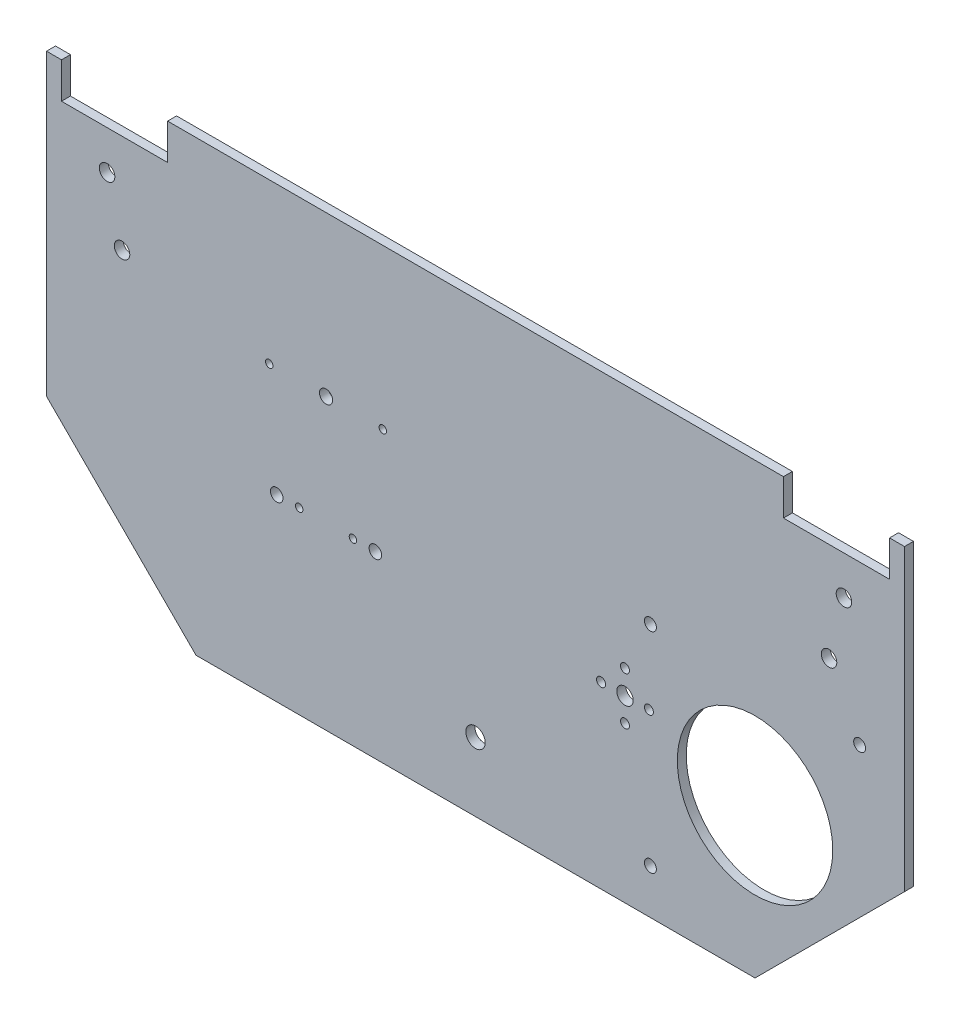
ISO-10303-21;
HEADER;
FILE_DESCRIPTION(('STEP AP214'),'2;1');
FILE_NAME('part.step','',(''),(''),'','','');
FILE_SCHEMA(('AUTOMOTIVE_DESIGN { 1 0 10303 214 1 1 1 1 }'));
ENDSEC;
DATA;
#1=APPLICATION_CONTEXT('core data for automotive mechanical design processes');
#2=APPLICATION_PROTOCOL_DEFINITION('international standard','automotive_design',2000,#1);
#3=PRODUCT_CONTEXT('',#1,'mechanical');
#4=PRODUCT('Part','Part','',(#3));
#5=PRODUCT_RELATED_PRODUCT_CATEGORY('part','',(#4));
#6=PRODUCT_DEFINITION_FORMATION('','',#4);
#7=PRODUCT_DEFINITION_CONTEXT('part definition',#1,'design');
#8=PRODUCT_DEFINITION('design','',#6,#7);
#9=PRODUCT_DEFINITION_SHAPE('','',#8);
#10=(LENGTH_UNIT() NAMED_UNIT(*) SI_UNIT(.MILLI.,.METRE.));
#11=(NAMED_UNIT(*) PLANE_ANGLE_UNIT() SI_UNIT($,.RADIAN.));
#12=(NAMED_UNIT(*) SI_UNIT($,.STERADIAN.) SOLID_ANGLE_UNIT());
#13=UNCERTAINTY_MEASURE_WITH_UNIT(LENGTH_MEASURE(1.E-05),#10,'distance_accuracy_value','');
#14=(GEOMETRIC_REPRESENTATION_CONTEXT(3) GLOBAL_UNCERTAINTY_ASSIGNED_CONTEXT((#13)) GLOBAL_UNIT_ASSIGNED_CONTEXT((#10,
#11,#12)) REPRESENTATION_CONTEXT('',''));
#15=CARTESIAN_POINT('',(0.,0.,0.));
#16=DIRECTION('',(0.,0.,1.));
#17=DIRECTION('',(1.,0.,0.));
#18=AXIS2_PLACEMENT_3D('',#15,#16,#17);
#19=CARTESIAN_POINT('',(0.,0.,3.));
#20=DIRECTION('',(0.,0.,1.));
#21=DIRECTION('',(1.,0.,0.));
#22=AXIS2_PLACEMENT_3D('',#19,#20,#21);
#23=PLANE('',#22);
#24=CARTESIAN_POINT('',(272.,85.,3.));
#25=DIRECTION('',(0.,0.,-1.));
#26=DIRECTION('',(-1.,0.,0.));
#27=AXIS2_PLACEMENT_3D('',#24,#25,#26);
#28=CIRCLE('',#27,2.);
#29=CARTESIAN_POINT('',(270.,85.,3.));
#30=VERTEX_POINT('',#29);
#31=EDGE_CURVE('E383',#30,#30,#28,.T.);
#32=ORIENTED_EDGE('',*,*,#31,.T.);
#33=EDGE_LOOP('',(#32));
#34=FACE_BOUND('',#33,.T.);
#35=CARTESIAN_POINT('',(202.,15.,3.));
#36=DIRECTION('',(0.,0.,-1.));
#37=DIRECTION('',(-1.,0.,0.));
#38=AXIS2_PLACEMENT_3D('',#35,#36,#37);
#39=CIRCLE('',#38,2.);
#40=CARTESIAN_POINT('',(200.,15.,3.));
#41=VERTEX_POINT('',#40);
#42=EDGE_CURVE('E378',#41,#41,#39,.T.);
#43=ORIENTED_EDGE('',*,*,#42,.T.);
#44=EDGE_LOOP('',(#43));
#45=FACE_BOUND('',#44,.T.);
#46=CARTESIAN_POINT('',(202.,85.,3.));
#47=DIRECTION('',(0.,0.,-1.));
#48=DIRECTION('',(-1.,0.,0.));
#49=AXIS2_PLACEMENT_3D('',#46,#47,#48);
#50=CIRCLE('',#49,2.);
#51=CARTESIAN_POINT('',(200.,85.,3.));
#52=VERTEX_POINT('',#51);
#53=EDGE_CURVE('E392',#52,#52,#50,.T.);
#54=ORIENTED_EDGE('',*,*,#53,.T.);
#55=EDGE_LOOP('',(#54));
#56=FACE_BOUND('',#55,.T.);
#57=CARTESIAN_POINT('',(193.5,52.0000000000001,3.));
#58=DIRECTION('',(0.,0.,1.));
#59=DIRECTION('',(1.,0.,0.));
#60=AXIS2_PLACEMENT_3D('',#57,#58,#59);
#61=CIRCLE('',#60,1.5);
#62=CARTESIAN_POINT('',(195.,52.0000000000001,3.));
#63=VERTEX_POINT('',#62);
#64=EDGE_CURVE('E404',#63,#63,#61,.T.);
#65=ORIENTED_EDGE('',*,*,#64,.F.);
#66=EDGE_LOOP('',(#65));
#67=FACE_BOUND('',#66,.T.);
#68=CARTESIAN_POINT('',(143.5,23.,3.));
#69=DIRECTION('',(0.,0.,1.));
#70=DIRECTION('',(1.,0.,0.));
#71=AXIS2_PLACEMENT_3D('',#68,#69,#70);
#72=CIRCLE('',#71,3.24999999999998);
#73=CARTESIAN_POINT('',(146.75,23.,3.));
#74=VERTEX_POINT('',#73);
#75=EDGE_CURVE('E416',#74,#74,#72,.T.);
#76=ORIENTED_EDGE('',*,*,#75,.F.);
#77=EDGE_LOOP('',(#76));
#78=FACE_BOUND('',#77,.T.);
#79=CARTESIAN_POINT('',(201.5,60.,3.));
#80=DIRECTION('',(0.,0.,1.));
#81=DIRECTION('',(1.,0.,0.));
#82=AXIS2_PLACEMENT_3D('',#79,#80,#81);
#83=CIRCLE('',#82,1.5);
#84=CARTESIAN_POINT('',(203.,60.,3.));
#85=VERTEX_POINT('',#84);
#86=EDGE_CURVE('E428',#85,#85,#83,.T.);
#87=ORIENTED_EDGE('',*,*,#86,.F.);
#88=EDGE_LOOP('',(#87));
#89=FACE_BOUND('',#88,.T.);
#90=CARTESIAN_POINT('',(112.5,96.7,3.));
#91=DIRECTION('',(0.,0.,1.));
#92=DIRECTION('',(1.,0.,0.));
#93=AXIS2_PLACEMENT_3D('',#90,#91,#92);
#94=CIRCLE('',#93,1.25);
#95=CARTESIAN_POINT('',(113.75,96.7,3.));
#96=VERTEX_POINT('',#95);
#97=EDGE_CURVE('E440',#96,#96,#94,.T.);
#98=ORIENTED_EDGE('',*,*,#97,.F.);
#99=EDGE_LOOP('',(#98));
#100=FACE_BOUND('',#99,.T.);
#101=CARTESIAN_POINT('',(84.5,60.,3.));
#102=DIRECTION('',(0.,0.,1.));
#103=DIRECTION('',(1.,0.,0.));
#104=AXIS2_PLACEMENT_3D('',#101,#102,#103);
#105=CIRCLE('',#104,1.25000000000001);
#106=CARTESIAN_POINT('',(85.7500000000001,60.,3.));
#107=VERTEX_POINT('',#106);
#108=EDGE_CURVE('E452',#107,#107,#105,.T.);
#109=ORIENTED_EDGE('',*,*,#108,.F.);
#110=EDGE_LOOP('',(#109));
#111=FACE_BOUND('',#110,.T.);
#112=CARTESIAN_POINT('',(110.,60.,3.));
#113=DIRECTION('',(0.,0.,1.));
#114=DIRECTION('',(1.,0.,0.));
#115=AXIS2_PLACEMENT_3D('',#112,#113,#114);
#116=CIRCLE('',#115,2.10000000000005);
#117=CARTESIAN_POINT('',(112.1,60.,3.));
#118=VERTEX_POINT('',#117);
#119=EDGE_CURVE('E464',#118,#118,#116,.T.);
#120=ORIENTED_EDGE('',*,*,#119,.F.);
#121=EDGE_LOOP('',(#120));
#122=FACE_BOUND('',#121,.T.);
#123=CARTESIAN_POINT('',(74.5,96.7,3.));
#124=DIRECTION('',(0.,0.,1.));
#125=DIRECTION('',(1.,0.,0.));
#126=AXIS2_PLACEMENT_3D('',#123,#124,#125);
#127=CIRCLE('',#126,1.25000000000001);
#128=CARTESIAN_POINT('',(75.75,96.7,3.));
#129=VERTEX_POINT('',#128);
#130=EDGE_CURVE('E476',#129,#129,#127,.T.);
#131=ORIENTED_EDGE('',*,*,#130,.F.);
#132=EDGE_LOOP('',(#131));
#133=FACE_BOUND('',#132,.T.);
#134=CARTESIAN_POINT('',(25.25,105.,3.));
#135=DIRECTION('',(0.,0.,1.));
#136=DIRECTION('',(1.,0.,0.));
#137=AXIS2_PLACEMENT_3D('',#134,#135,#136);
#138=CIRCLE('',#137,2.59999999999999);
#139=CARTESIAN_POINT('',(27.85,105.,3.));
#140=VERTEX_POINT('',#139);
#141=EDGE_CURVE('E488',#140,#140,#138,.T.);
#142=ORIENTED_EDGE('',*,*,#141,.F.);
#143=EDGE_LOOP('',(#142));
#144=FACE_BOUND('',#143,.T.);
#145=CARTESIAN_POINT('',(266.75,125.,3.));
#146=DIRECTION('',(0.,0.,1.));
#147=DIRECTION('',(1.,0.,0.));
#148=AXIS2_PLACEMENT_3D('',#145,#146,#147);
#149=CIRCLE('',#148,2.60000000000007);
#150=CARTESIAN_POINT('',(269.35,125.,3.));
#151=VERTEX_POINT('',#150);
#152=EDGE_CURVE('E170',#151,#151,#149,.T.);
#153=ORIENTED_EDGE('',*,*,#152,.F.);
#154=EDGE_LOOP('',(#153));
#155=FACE_BOUND('',#154,.T.);
#156=DIRECTION('',(0.,1.,0.));
#157=VECTOR('',#156,1.);
#158=CARTESIAN_POINT('',(5.,138.,3.));
#159=LINE('',#158,#157);
#160=CARTESIAN_POINT('',(5.,138.,3.));
#161=VERTEX_POINT('',#160);
#162=CARTESIAN_POINT('',(5.,150.,3.));
#163=VERTEX_POINT('',#162);
#164=EDGE_CURVE('E193',#161,#163,#159,.T.);
#165=ORIENTED_EDGE('',*,*,#164,.T.);
#166=DIRECTION('',(-1.,0.,0.));
#167=VECTOR('',#166,1.);
#168=CARTESIAN_POINT('',(5.,150.,3.));
#169=LINE('',#168,#167);
#170=CARTESIAN_POINT('',(0.,150.,3.));
#171=VERTEX_POINT('',#170);
#172=EDGE_CURVE('E111',#163,#171,#169,.T.);
#173=ORIENTED_EDGE('',*,*,#172,.T.);
#174=DIRECTION('',(0.,-1.,0.));
#175=VECTOR('',#174,1.);
#176=CARTESIAN_POINT('',(0.,150.,3.));
#177=LINE('',#176,#175);
#178=CARTESIAN_POINT('',(0.,50.,3.));
#179=VERTEX_POINT('',#178);
#180=EDGE_CURVE('E226',#171,#179,#177,.T.);
#181=ORIENTED_EDGE('',*,*,#180,.T.);
#182=DIRECTION('',(0.707106781186548,-0.707106781186548,0.));
#183=VECTOR('',#182,1.);
#184=CARTESIAN_POINT('',(0.,50.,3.));
#185=LINE('',#184,#183);
#186=CARTESIAN_POINT('',(50.,0.,3.));
#187=VERTEX_POINT('',#186);
#188=EDGE_CURVE('E245',#179,#187,#185,.T.);
#189=ORIENTED_EDGE('',*,*,#188,.T.);
#190=DIRECTION('',(1.,0.,0.));
#191=VECTOR('',#190,1.);
#192=CARTESIAN_POINT('',(50.,0.,3.));
#193=LINE('',#192,#191);
#194=CARTESIAN_POINT('',(237.,0.,3.));
#195=VERTEX_POINT('',#194);
#196=EDGE_CURVE('E242',#187,#195,#193,.T.);
#197=ORIENTED_EDGE('',*,*,#196,.T.);
#198=DIRECTION('',(0.707106781186548,0.707106781186547,0.));
#199=VECTOR('',#198,1.);
#200=CARTESIAN_POINT('',(237.,0.,3.));
#201=LINE('',#200,#199);
#202=CARTESIAN_POINT('',(287.,50.,3.));
#203=VERTEX_POINT('',#202);
#204=EDGE_CURVE('E244',#195,#203,#201,.T.);
#205=ORIENTED_EDGE('',*,*,#204,.T.);
#206=DIRECTION('',(0.,1.,0.));
#207=VECTOR('',#206,1.);
#208=CARTESIAN_POINT('',(287.,50.,3.));
#209=LINE('',#208,#207);
#210=CARTESIAN_POINT('',(287.,150.,3.));
#211=VERTEX_POINT('',#210);
#212=EDGE_CURVE('E247',#203,#211,#209,.T.);
#213=ORIENTED_EDGE('',*,*,#212,.T.);
#214=DIRECTION('',(-1.,0.,0.));
#215=VECTOR('',#214,1.);
#216=CARTESIAN_POINT('',(287.,150.,3.));
#217=LINE('',#216,#215);
#218=CARTESIAN_POINT('',(282.,150.,3.));
#219=VERTEX_POINT('',#218);
#220=EDGE_CURVE('E253',#211,#219,#217,.T.);
#221=ORIENTED_EDGE('',*,*,#220,.T.);
#222=DIRECTION('',(0.,-1.,0.));
#223=VECTOR('',#222,1.);
#224=CARTESIAN_POINT('',(282.,150.,3.));
#225=LINE('',#224,#223);
#226=CARTESIAN_POINT('',(282.,138.,3.));
#227=VERTEX_POINT('',#226);
#228=EDGE_CURVE('E255',#219,#227,#225,.T.);
#229=ORIENTED_EDGE('',*,*,#228,.T.);
#230=DIRECTION('',(-1.,0.,0.));
#231=VECTOR('',#230,1.);
#232=CARTESIAN_POINT('',(282.,138.,3.));
#233=LINE('',#232,#231);
#234=CARTESIAN_POINT('',(246.5,138.,3.));
#235=VERTEX_POINT('',#234);
#236=EDGE_CURVE('E257',#227,#235,#233,.T.);
#237=ORIENTED_EDGE('',*,*,#236,.T.);
#238=DIRECTION('',(0.,1.,0.));
#239=VECTOR('',#238,1.);
#240=CARTESIAN_POINT('',(246.5,138.,3.));
#241=LINE('',#240,#239);
#242=CARTESIAN_POINT('',(246.5,150.,3.));
#243=VERTEX_POINT('',#242);
#244=EDGE_CURVE('E148',#235,#243,#241,.T.);
#245=ORIENTED_EDGE('',*,*,#244,.T.);
#246=DIRECTION('',(-1.,0.,0.));
#247=VECTOR('',#246,1.);
#248=CARTESIAN_POINT('',(246.5,150.,3.));
#249=LINE('',#248,#247);
#250=CARTESIAN_POINT('',(40.5,150.,3.));
#251=VERTEX_POINT('',#250);
#252=EDGE_CURVE('E142',#243,#251,#249,.T.);
#253=ORIENTED_EDGE('',*,*,#252,.T.);
#254=DIRECTION('',(0.,-1.,0.));
#255=VECTOR('',#254,1.);
#256=CARTESIAN_POINT('',(40.5,150.,3.));
#257=LINE('',#256,#255);
#258=CARTESIAN_POINT('',(40.5,138.,3.));
#259=VERTEX_POINT('',#258);
#260=EDGE_CURVE('E146',#251,#259,#257,.T.);
#261=ORIENTED_EDGE('',*,*,#260,.T.);
#262=DIRECTION('',(-1.,0.,0.));
#263=VECTOR('',#262,1.);
#264=CARTESIAN_POINT('',(40.5,138.,3.));
#265=LINE('',#264,#263);
#266=EDGE_CURVE('E50',#259,#161,#265,.T.);
#267=ORIENTED_EDGE('',*,*,#266,.T.);
#268=EDGE_LOOP('',(#165,#173,#181,#189,#197,#205,#213,#221,#229,#237,#245,#253,#261,#267));
#269=FACE_BOUND('',#268,.T.);
#270=CARTESIAN_POINT('',(261.75,105.,3.));
#271=DIRECTION('',(0.,0.,1.));
#272=DIRECTION('',(1.,0.,0.));
#273=AXIS2_PLACEMENT_3D('',#270,#271,#272);
#274=CIRCLE('',#273,2.60000000000006);
#275=CARTESIAN_POINT('',(264.35,105.,3.));
#276=VERTEX_POINT('',#275);
#277=EDGE_CURVE('E494',#276,#276,#274,.T.);
#278=ORIENTED_EDGE('',*,*,#277,.F.);
#279=EDGE_LOOP('',(#278));
#280=FACE_BOUND('',#279,.T.);
#281=CARTESIAN_POINT('',(20.25,125.,3.));
#282=DIRECTION('',(0.,0.,1.));
#283=DIRECTION('',(1.,0.,0.));
#284=AXIS2_PLACEMENT_3D('',#281,#282,#283);
#285=CIRCLE('',#284,2.59999999999999);
#286=CARTESIAN_POINT('',(22.85,125.,3.));
#287=VERTEX_POINT('',#286);
#288=EDGE_CURVE('E482',#287,#287,#285,.T.);
#289=ORIENTED_EDGE('',*,*,#288,.F.);
#290=EDGE_LOOP('',(#289));
#291=FACE_BOUND('',#290,.T.);
#292=CARTESIAN_POINT('',(93.5,96.7,3.));
#293=DIRECTION('',(0.,0.,1.));
#294=DIRECTION('',(1.,0.,0.));
#295=AXIS2_PLACEMENT_3D('',#292,#293,#294);
#296=CIRCLE('',#295,2.20000000000003);
#297=CARTESIAN_POINT('',(95.7000000000001,96.7,3.));
#298=VERTEX_POINT('',#297);
#299=EDGE_CURVE('E470',#298,#298,#296,.T.);
#300=ORIENTED_EDGE('',*,*,#299,.F.);
#301=EDGE_LOOP('',(#300));
#302=FACE_BOUND('',#301,.T.);
#303=CARTESIAN_POINT('',(77.,60.,3.));
#304=DIRECTION('',(0.,0.,1.));
#305=DIRECTION('',(1.,0.,0.));
#306=AXIS2_PLACEMENT_3D('',#303,#304,#305);
#307=CIRCLE('',#306,2.10000000000003);
#308=CARTESIAN_POINT('',(79.1000000000001,60.,3.));
#309=VERTEX_POINT('',#308);
#310=EDGE_CURVE('E458',#309,#309,#307,.T.);
#311=ORIENTED_EDGE('',*,*,#310,.F.);
#312=EDGE_LOOP('',(#311));
#313=FACE_BOUND('',#312,.T.);
#314=CARTESIAN_POINT('',(102.5,60.,3.));
#315=DIRECTION('',(0.,0.,1.));
#316=DIRECTION('',(1.,0.,0.));
#317=AXIS2_PLACEMENT_3D('',#314,#315,#316);
#318=CIRCLE('',#317,1.25);
#319=CARTESIAN_POINT('',(103.75,60.,3.));
#320=VERTEX_POINT('',#319);
#321=EDGE_CURVE('E446',#320,#320,#318,.T.);
#322=ORIENTED_EDGE('',*,*,#321,.F.);
#323=EDGE_LOOP('',(#322));
#324=FACE_BOUND('',#323,.T.);
#325=CARTESIAN_POINT('',(193.5,60.,3.));
#326=DIRECTION('',(0.,0.,1.));
#327=DIRECTION('',(1.,0.,0.));
#328=AXIS2_PLACEMENT_3D('',#325,#326,#327);
#329=CIRCLE('',#328,2.75000000000001);
#330=CARTESIAN_POINT('',(196.25,60.,3.));
#331=VERTEX_POINT('',#330);
#332=EDGE_CURVE('E434',#331,#331,#329,.T.);
#333=ORIENTED_EDGE('',*,*,#332,.F.);
#334=EDGE_LOOP('',(#333));
#335=FACE_BOUND('',#334,.T.);
#336=CARTESIAN_POINT('',(185.5,60.,3.));
#337=DIRECTION('',(0.,0.,1.));
#338=DIRECTION('',(1.,0.,0.));
#339=AXIS2_PLACEMENT_3D('',#336,#337,#338);
#340=CIRCLE('',#339,1.49999999999997);
#341=CARTESIAN_POINT('',(187.,60.,3.));
#342=VERTEX_POINT('',#341);
#343=EDGE_CURVE('E422',#342,#342,#340,.T.);
#344=ORIENTED_EDGE('',*,*,#343,.F.);
#345=EDGE_LOOP('',(#344));
#346=FACE_BOUND('',#345,.T.);
#347=CARTESIAN_POINT('',(237.,50.,3.));
#348=DIRECTION('',(0.,0.,1.));
#349=DIRECTION('',(1.,0.,0.));
#350=AXIS2_PLACEMENT_3D('',#347,#348,#349);
#351=CIRCLE('',#350,26.);
#352=CARTESIAN_POINT('',(263.,50.,3.));
#353=VERTEX_POINT('',#352);
#354=EDGE_CURVE('E410',#353,#353,#351,.T.);
#355=ORIENTED_EDGE('',*,*,#354,.F.);
#356=EDGE_LOOP('',(#355));
#357=FACE_BOUND('',#356,.T.);
#358=CARTESIAN_POINT('',(193.5,68.0000000000001,3.));
#359=DIRECTION('',(0.,0.,1.));
#360=DIRECTION('',(1.,0.,0.));
#361=AXIS2_PLACEMENT_3D('',#358,#359,#360);
#362=CIRCLE('',#361,1.49999999999997);
#363=CARTESIAN_POINT('',(195.,68.0000000000001,3.));
#364=VERTEX_POINT('',#363);
#365=EDGE_CURVE('E398',#364,#364,#362,.T.);
#366=ORIENTED_EDGE('',*,*,#365,.F.);
#367=EDGE_LOOP('',(#366));
#368=FACE_BOUND('',#367,.T.);
#369=ADVANCED_FACE('F33',(#34,#45,#56,#67,#78,#89,#100,#111,#122,#133,#144,#155,#269,#280,#291,
#302,#313,#324,#335,#346,#357,#368),#23,.T.);
#370=CARTESIAN_POINT('',(0.,0.,0.));
#371=DIRECTION('',(0.,0.,1.));
#372=DIRECTION('',(1.,0.,0.));
#373=AXIS2_PLACEMENT_3D('',#370,#371,#372);
#374=PLANE('',#373);
#375=CARTESIAN_POINT('',(272.,85.,0.));
#376=DIRECTION('',(0.,0.,-1.));
#377=DIRECTION('',(-1.,0.,0.));
#378=AXIS2_PLACEMENT_3D('',#375,#376,#377);
#379=CIRCLE('',#378,2.);
#380=CARTESIAN_POINT('',(270.,85.,0.));
#381=VERTEX_POINT('',#380);
#382=EDGE_CURVE('E387',#381,#381,#379,.T.);
#383=ORIENTED_EDGE('',*,*,#382,.F.);
#384=EDGE_LOOP('',(#383));
#385=FACE_BOUND('',#384,.T.);
#386=CARTESIAN_POINT('',(202.,15.,0.));
#387=DIRECTION('',(0.,0.,-1.));
#388=DIRECTION('',(-1.,0.,0.));
#389=AXIS2_PLACEMENT_3D('',#386,#387,#388);
#390=CIRCLE('',#389,2.);
#391=CARTESIAN_POINT('',(200.,15.,0.));
#392=VERTEX_POINT('',#391);
#393=EDGE_CURVE('E381',#392,#392,#390,.T.);
#394=ORIENTED_EDGE('',*,*,#393,.F.);
#395=EDGE_LOOP('',(#394));
#396=FACE_BOUND('',#395,.T.);
#397=CARTESIAN_POINT('',(202.,85.,0.));
#398=DIRECTION('',(0.,0.,-1.));
#399=DIRECTION('',(-1.,0.,0.));
#400=AXIS2_PLACEMENT_3D('',#397,#398,#399);
#401=CIRCLE('',#400,2.);
#402=CARTESIAN_POINT('',(200.,85.,0.));
#403=VERTEX_POINT('',#402);
#404=EDGE_CURVE('E385',#403,#403,#401,.T.);
#405=ORIENTED_EDGE('',*,*,#404,.F.);
#406=EDGE_LOOP('',(#405));
#407=FACE_BOUND('',#406,.T.);
#408=DIRECTION('',(0.,1.,0.));
#409=VECTOR('',#408,1.);
#410=CARTESIAN_POINT('',(5.,138.,0.));
#411=LINE('',#410,#409);
#412=CARTESIAN_POINT('',(5.,138.,0.));
#413=VERTEX_POINT('',#412);
#414=CARTESIAN_POINT('',(5.,150.,0.));
#415=VERTEX_POINT('',#414);
#416=EDGE_CURVE('E166',#413,#415,#411,.T.);
#417=ORIENTED_EDGE('',*,*,#416,.F.);
#418=DIRECTION('',(-1.,0.,0.));
#419=VECTOR('',#418,1.);
#420=CARTESIAN_POINT('',(40.5,138.,0.));
#421=LINE('',#420,#419);
#422=CARTESIAN_POINT('',(40.5,138.,0.));
#423=VERTEX_POINT('',#422);
#424=EDGE_CURVE('E103',#423,#413,#421,.T.);
#425=ORIENTED_EDGE('',*,*,#424,.F.);
#426=DIRECTION('',(0.,-1.,0.));
#427=VECTOR('',#426,1.);
#428=CARTESIAN_POINT('',(40.5,150.,0.));
#429=LINE('',#428,#427);
#430=CARTESIAN_POINT('',(40.5,150.,0.));
#431=VERTEX_POINT('',#430);
#432=EDGE_CURVE('E97',#431,#423,#429,.T.);
#433=ORIENTED_EDGE('',*,*,#432,.F.);
#434=DIRECTION('',(-1.,0.,0.));
#435=VECTOR('',#434,1.);
#436=CARTESIAN_POINT('',(246.5,150.,0.));
#437=LINE('',#436,#435);
#438=CARTESIAN_POINT('',(246.5,150.,0.));
#439=VERTEX_POINT('',#438);
#440=EDGE_CURVE('E156',#439,#431,#437,.T.);
#441=ORIENTED_EDGE('',*,*,#440,.F.);
#442=DIRECTION('',(0.,1.,0.));
#443=VECTOR('',#442,1.);
#444=CARTESIAN_POINT('',(246.5,138.,0.));
#445=LINE('',#444,#443);
#446=CARTESIAN_POINT('',(246.5,138.,0.));
#447=VERTEX_POINT('',#446);
#448=EDGE_CURVE('E188',#447,#439,#445,.T.);
#449=ORIENTED_EDGE('',*,*,#448,.F.);
#450=DIRECTION('',(-1.,0.,0.));
#451=VECTOR('',#450,1.);
#452=CARTESIAN_POINT('',(282.,138.,0.));
#453=LINE('',#452,#451);
#454=CARTESIAN_POINT('',(282.,138.,0.));
#455=VERTEX_POINT('',#454);
#456=EDGE_CURVE('E186',#455,#447,#453,.T.);
#457=ORIENTED_EDGE('',*,*,#456,.F.);
#458=DIRECTION('',(0.,-1.,0.));
#459=VECTOR('',#458,1.);
#460=CARTESIAN_POINT('',(282.,150.,0.));
#461=LINE('',#460,#459);
#462=CARTESIAN_POINT('',(282.,150.,0.));
#463=VERTEX_POINT('',#462);
#464=EDGE_CURVE('E184',#463,#455,#461,.T.);
#465=ORIENTED_EDGE('',*,*,#464,.F.);
#466=DIRECTION('',(-1.,0.,0.));
#467=VECTOR('',#466,1.);
#468=CARTESIAN_POINT('',(287.,150.,0.));
#469=LINE('',#468,#467);
#470=CARTESIAN_POINT('',(287.,150.,0.));
#471=VERTEX_POINT('',#470);
#472=EDGE_CURVE('E182',#471,#463,#469,.T.);
#473=ORIENTED_EDGE('',*,*,#472,.F.);
#474=DIRECTION('',(0.,1.,0.));
#475=VECTOR('',#474,1.);
#476=CARTESIAN_POINT('',(287.,50.,0.));
#477=LINE('',#476,#475);
#478=CARTESIAN_POINT('',(287.,50.,0.));
#479=VERTEX_POINT('',#478);
#480=EDGE_CURVE('E180',#479,#471,#477,.T.);
#481=ORIENTED_EDGE('',*,*,#480,.F.);
#482=DIRECTION('',(0.707106781186548,0.707106781186547,0.));
#483=VECTOR('',#482,1.);
#484=CARTESIAN_POINT('',(237.,0.,0.));
#485=LINE('',#484,#483);
#486=CARTESIAN_POINT('',(237.,0.,0.));
#487=VERTEX_POINT('',#486);
#488=EDGE_CURVE('E178',#487,#479,#485,.T.);
#489=ORIENTED_EDGE('',*,*,#488,.F.);
#490=DIRECTION('',(1.,0.,0.));
#491=VECTOR('',#490,1.);
#492=CARTESIAN_POINT('',(50.,0.,0.));
#493=LINE('',#492,#491);
#494=CARTESIAN_POINT('',(50.,0.,0.));
#495=VERTEX_POINT('',#494);
#496=EDGE_CURVE('E176',#495,#487,#493,.T.);
#497=ORIENTED_EDGE('',*,*,#496,.F.);
#498=DIRECTION('',(0.707106781186548,-0.707106781186548,0.));
#499=VECTOR('',#498,1.);
#500=CARTESIAN_POINT('',(0.,50.,0.));
#501=LINE('',#500,#499);
#502=CARTESIAN_POINT('',(0.,50.,0.));
#503=VERTEX_POINT('',#502);
#504=EDGE_CURVE('E174',#503,#495,#501,.T.);
#505=ORIENTED_EDGE('',*,*,#504,.F.);
#506=DIRECTION('',(0.,-1.,0.));
#507=VECTOR('',#506,1.);
#508=CARTESIAN_POINT('',(0.,150.,0.));
#509=LINE('',#508,#507);
#510=CARTESIAN_POINT('',(0.,150.,0.));
#511=VERTEX_POINT('',#510);
#512=EDGE_CURVE('E172',#511,#503,#509,.T.);
#513=ORIENTED_EDGE('',*,*,#512,.F.);
#514=DIRECTION('',(-1.,0.,0.));
#515=VECTOR('',#514,1.);
#516=CARTESIAN_POINT('',(5.,150.,0.));
#517=LINE('',#516,#515);
#518=EDGE_CURVE('E169',#415,#511,#517,.T.);
#519=ORIENTED_EDGE('',*,*,#518,.F.);
#520=EDGE_LOOP('',(#417,#425,#433,#441,#449,#457,#465,#473,#481,#489,#497,#505,#513,#519));
#521=FACE_BOUND('',#520,.T.);
#522=CARTESIAN_POINT('',(266.75,125.,0.));
#523=DIRECTION('',(0.,0.,1.));
#524=DIRECTION('',(1.,0.,0.));
#525=AXIS2_PLACEMENT_3D('',#522,#523,#524);
#526=CIRCLE('',#525,2.60000000000007);
#527=CARTESIAN_POINT('',(269.35,125.,0.));
#528=VERTEX_POINT('',#527);
#529=EDGE_CURVE('E497',#528,#528,#526,.T.);
#530=ORIENTED_EDGE('',*,*,#529,.T.);
#531=EDGE_LOOP('',(#530));
#532=FACE_BOUND('',#531,.T.);
#533=CARTESIAN_POINT('',(261.75,105.,0.));
#534=DIRECTION('',(0.,0.,1.));
#535=DIRECTION('',(1.,0.,0.));
#536=AXIS2_PLACEMENT_3D('',#533,#534,#535);
#537=CIRCLE('',#536,2.60000000000006);
#538=CARTESIAN_POINT('',(264.35,105.,0.));
#539=VERTEX_POINT('',#538);
#540=EDGE_CURVE('E491',#539,#539,#537,.T.);
#541=ORIENTED_EDGE('',*,*,#540,.T.);
#542=EDGE_LOOP('',(#541));
#543=FACE_BOUND('',#542,.T.);
#544=CARTESIAN_POINT('',(25.25,105.,0.));
#545=DIRECTION('',(0.,0.,1.));
#546=DIRECTION('',(1.,0.,0.));
#547=AXIS2_PLACEMENT_3D('',#544,#545,#546);
#548=CIRCLE('',#547,2.59999999999999);
#549=CARTESIAN_POINT('',(27.85,105.,0.));
#550=VERTEX_POINT('',#549);
#551=EDGE_CURVE('E485',#550,#550,#548,.T.);
#552=ORIENTED_EDGE('',*,*,#551,.T.);
#553=EDGE_LOOP('',(#552));
#554=FACE_BOUND('',#553,.T.);
#555=CARTESIAN_POINT('',(20.25,125.,0.));
#556=DIRECTION('',(0.,0.,1.));
#557=DIRECTION('',(1.,0.,0.));
#558=AXIS2_PLACEMENT_3D('',#555,#556,#557);
#559=CIRCLE('',#558,2.59999999999999);
#560=CARTESIAN_POINT('',(22.85,125.,0.));
#561=VERTEX_POINT('',#560);
#562=EDGE_CURVE('E479',#561,#561,#559,.T.);
#563=ORIENTED_EDGE('',*,*,#562,.T.);
#564=EDGE_LOOP('',(#563));
#565=FACE_BOUND('',#564,.T.);
#566=CARTESIAN_POINT('',(74.5,96.7,0.));
#567=DIRECTION('',(0.,0.,1.));
#568=DIRECTION('',(1.,0.,0.));
#569=AXIS2_PLACEMENT_3D('',#566,#567,#568);
#570=CIRCLE('',#569,1.25000000000001);
#571=CARTESIAN_POINT('',(75.75,96.7,0.));
#572=VERTEX_POINT('',#571);
#573=EDGE_CURVE('E473',#572,#572,#570,.T.);
#574=ORIENTED_EDGE('',*,*,#573,.T.);
#575=EDGE_LOOP('',(#574));
#576=FACE_BOUND('',#575,.T.);
#577=CARTESIAN_POINT('',(93.5,96.7,0.));
#578=DIRECTION('',(0.,0.,1.));
#579=DIRECTION('',(1.,0.,0.));
#580=AXIS2_PLACEMENT_3D('',#577,#578,#579);
#581=CIRCLE('',#580,2.20000000000003);
#582=CARTESIAN_POINT('',(95.7000000000001,96.7,0.));
#583=VERTEX_POINT('',#582);
#584=EDGE_CURVE('E467',#583,#583,#581,.T.);
#585=ORIENTED_EDGE('',*,*,#584,.T.);
#586=EDGE_LOOP('',(#585));
#587=FACE_BOUND('',#586,.T.);
#588=CARTESIAN_POINT('',(110.,60.,0.));
#589=DIRECTION('',(0.,0.,1.));
#590=DIRECTION('',(1.,0.,0.));
#591=AXIS2_PLACEMENT_3D('',#588,#589,#590);
#592=CIRCLE('',#591,2.10000000000005);
#593=CARTESIAN_POINT('',(112.1,60.,0.));
#594=VERTEX_POINT('',#593);
#595=EDGE_CURVE('E461',#594,#594,#592,.T.);
#596=ORIENTED_EDGE('',*,*,#595,.T.);
#597=EDGE_LOOP('',(#596));
#598=FACE_BOUND('',#597,.T.);
#599=CARTESIAN_POINT('',(77.,60.,0.));
#600=DIRECTION('',(0.,0.,1.));
#601=DIRECTION('',(1.,0.,0.));
#602=AXIS2_PLACEMENT_3D('',#599,#600,#601);
#603=CIRCLE('',#602,2.10000000000003);
#604=CARTESIAN_POINT('',(79.1000000000001,60.,0.));
#605=VERTEX_POINT('',#604);
#606=EDGE_CURVE('E455',#605,#605,#603,.T.);
#607=ORIENTED_EDGE('',*,*,#606,.T.);
#608=EDGE_LOOP('',(#607));
#609=FACE_BOUND('',#608,.T.);
#610=CARTESIAN_POINT('',(84.5,60.,0.));
#611=DIRECTION('',(0.,0.,1.));
#612=DIRECTION('',(1.,0.,0.));
#613=AXIS2_PLACEMENT_3D('',#610,#611,#612);
#614=CIRCLE('',#613,1.25000000000001);
#615=CARTESIAN_POINT('',(85.7500000000001,60.,0.));
#616=VERTEX_POINT('',#615);
#617=EDGE_CURVE('E449',#616,#616,#614,.T.);
#618=ORIENTED_EDGE('',*,*,#617,.T.);
#619=EDGE_LOOP('',(#618));
#620=FACE_BOUND('',#619,.T.);
#621=CARTESIAN_POINT('',(102.5,60.,0.));
#622=DIRECTION('',(0.,0.,1.));
#623=DIRECTION('',(1.,0.,0.));
#624=AXIS2_PLACEMENT_3D('',#621,#622,#623);
#625=CIRCLE('',#624,1.25);
#626=CARTESIAN_POINT('',(103.75,60.,0.));
#627=VERTEX_POINT('',#626);
#628=EDGE_CURVE('E443',#627,#627,#625,.T.);
#629=ORIENTED_EDGE('',*,*,#628,.T.);
#630=EDGE_LOOP('',(#629));
#631=FACE_BOUND('',#630,.T.);
#632=CARTESIAN_POINT('',(112.5,96.7,0.));
#633=DIRECTION('',(0.,0.,1.));
#634=DIRECTION('',(1.,0.,0.));
#635=AXIS2_PLACEMENT_3D('',#632,#633,#634);
#636=CIRCLE('',#635,1.25);
#637=CARTESIAN_POINT('',(113.75,96.7,0.));
#638=VERTEX_POINT('',#637);
#639=EDGE_CURVE('E437',#638,#638,#636,.T.);
#640=ORIENTED_EDGE('',*,*,#639,.T.);
#641=EDGE_LOOP('',(#640));
#642=FACE_BOUND('',#641,.T.);
#643=CARTESIAN_POINT('',(193.5,60.,0.));
#644=DIRECTION('',(0.,0.,1.));
#645=DIRECTION('',(1.,0.,0.));
#646=AXIS2_PLACEMENT_3D('',#643,#644,#645);
#647=CIRCLE('',#646,2.75000000000001);
#648=CARTESIAN_POINT('',(196.25,60.,0.));
#649=VERTEX_POINT('',#648);
#650=EDGE_CURVE('E431',#649,#649,#647,.T.);
#651=ORIENTED_EDGE('',*,*,#650,.T.);
#652=EDGE_LOOP('',(#651));
#653=FACE_BOUND('',#652,.T.);
#654=CARTESIAN_POINT('',(201.5,60.,0.));
#655=DIRECTION('',(0.,0.,1.));
#656=DIRECTION('',(1.,0.,0.));
#657=AXIS2_PLACEMENT_3D('',#654,#655,#656);
#658=CIRCLE('',#657,1.5);
#659=CARTESIAN_POINT('',(203.,60.,0.));
#660=VERTEX_POINT('',#659);
#661=EDGE_CURVE('E425',#660,#660,#658,.T.);
#662=ORIENTED_EDGE('',*,*,#661,.T.);
#663=EDGE_LOOP('',(#662));
#664=FACE_BOUND('',#663,.T.);
#665=CARTESIAN_POINT('',(185.5,60.,0.));
#666=DIRECTION('',(0.,0.,1.));
#667=DIRECTION('',(1.,0.,0.));
#668=AXIS2_PLACEMENT_3D('',#665,#666,#667);
#669=CIRCLE('',#668,1.49999999999997);
#670=CARTESIAN_POINT('',(187.,60.,0.));
#671=VERTEX_POINT('',#670);
#672=EDGE_CURVE('E419',#671,#671,#669,.T.);
#673=ORIENTED_EDGE('',*,*,#672,.T.);
#674=EDGE_LOOP('',(#673));
#675=FACE_BOUND('',#674,.T.);
#676=CARTESIAN_POINT('',(143.5,23.,0.));
#677=DIRECTION('',(0.,0.,1.));
#678=DIRECTION('',(1.,0.,0.));
#679=AXIS2_PLACEMENT_3D('',#676,#677,#678);
#680=CIRCLE('',#679,3.24999999999998);
#681=CARTESIAN_POINT('',(146.75,23.,0.));
#682=VERTEX_POINT('',#681);
#683=EDGE_CURVE('E413',#682,#682,#680,.T.);
#684=ORIENTED_EDGE('',*,*,#683,.T.);
#685=EDGE_LOOP('',(#684));
#686=FACE_BOUND('',#685,.T.);
#687=CARTESIAN_POINT('',(237.,50.,0.));
#688=DIRECTION('',(0.,0.,1.));
#689=DIRECTION('',(1.,0.,0.));
#690=AXIS2_PLACEMENT_3D('',#687,#688,#689);
#691=CIRCLE('',#690,26.);
#692=CARTESIAN_POINT('',(263.,50.,0.));
#693=VERTEX_POINT('',#692);
#694=EDGE_CURVE('E407',#693,#693,#691,.T.);
#695=ORIENTED_EDGE('',*,*,#694,.T.);
#696=EDGE_LOOP('',(#695));
#697=FACE_BOUND('',#696,.T.);
#698=CARTESIAN_POINT('',(193.5,52.0000000000001,0.));
#699=DIRECTION('',(0.,0.,1.));
#700=DIRECTION('',(1.,0.,0.));
#701=AXIS2_PLACEMENT_3D('',#698,#699,#700);
#702=CIRCLE('',#701,1.5);
#703=CARTESIAN_POINT('',(195.,52.0000000000001,0.));
#704=VERTEX_POINT('',#703);
#705=EDGE_CURVE('E401',#704,#704,#702,.T.);
#706=ORIENTED_EDGE('',*,*,#705,.T.);
#707=EDGE_LOOP('',(#706));
#708=FACE_BOUND('',#707,.T.);
#709=CARTESIAN_POINT('',(193.5,68.0000000000001,0.));
#710=DIRECTION('',(0.,0.,1.));
#711=DIRECTION('',(1.,0.,0.));
#712=AXIS2_PLACEMENT_3D('',#709,#710,#711);
#713=CIRCLE('',#712,1.49999999999997);
#714=CARTESIAN_POINT('',(195.,68.0000000000001,0.));
#715=VERTEX_POINT('',#714);
#716=EDGE_CURVE('E395',#715,#715,#713,.T.);
#717=ORIENTED_EDGE('',*,*,#716,.T.);
#718=EDGE_LOOP('',(#717));
#719=FACE_BOUND('',#718,.T.);
#720=ADVANCED_FACE('F230',(#385,#396,#407,#521,#532,#543,#554,#565,#576,#587,#598,#609,#620,
#631,#642,#653,#664,#675,#686,#697,#708,#719),#374,.F.);
#721=CARTESIAN_POINT('',(5.,138.,3.));
#722=DIRECTION('',(-1.,0.,0.));
#723=DIRECTION('',(0.,-1.,0.));
#724=AXIS2_PLACEMENT_3D('',#721,#722,#723);
#725=PLANE('',#724);
#726=ORIENTED_EDGE('',*,*,#416,.T.);
#727=DIRECTION('',(0.,0.,-1.));
#728=VECTOR('',#727,1.);
#729=CARTESIAN_POINT('',(5.,150.,3.));
#730=LINE('',#729,#728);
#731=EDGE_CURVE('E11',#163,#415,#730,.T.);
#732=ORIENTED_EDGE('',*,*,#731,.F.);
#733=ORIENTED_EDGE('',*,*,#164,.F.);
#734=DIRECTION('',(0.,0.,-1.));
#735=VECTOR('',#734,1.);
#736=CARTESIAN_POINT('',(5.,138.,3.));
#737=LINE('',#736,#735);
#738=EDGE_CURVE('E162',#161,#413,#737,.T.);
#739=ORIENTED_EDGE('',*,*,#738,.T.);
#740=EDGE_LOOP('',(#726,#732,#733,#739));
#741=FACE_BOUND('',#740,.T.);
#742=ADVANCED_FACE('F35',(#741),#725,.F.);
#743=CARTESIAN_POINT('',(5.,150.,3.));
#744=DIRECTION('',(0.,-1.,0.));
#745=DIRECTION('',(0.,0.,-1.));
#746=AXIS2_PLACEMENT_3D('',#743,#744,#745);
#747=PLANE('',#746);
#748=ORIENTED_EDGE('',*,*,#518,.T.);
#749=DIRECTION('',(0.,0.,-1.));
#750=VECTOR('',#749,1.);
#751=CARTESIAN_POINT('',(0.,150.,3.));
#752=LINE('',#751,#750);
#753=EDGE_CURVE('E42',#171,#511,#752,.T.);
#754=ORIENTED_EDGE('',*,*,#753,.F.);
#755=ORIENTED_EDGE('',*,*,#172,.F.);
#756=ORIENTED_EDGE('',*,*,#731,.T.);
#757=EDGE_LOOP('',(#748,#754,#755,#756));
#758=FACE_BOUND('',#757,.T.);
#759=ADVANCED_FACE('F792',(#758),#747,.F.);
#760=CARTESIAN_POINT('',(0.,150.,3.));
#761=DIRECTION('',(1.,0.,0.));
#762=DIRECTION('',(0.,0.,-1.));
#763=AXIS2_PLACEMENT_3D('',#760,#761,#762);
#764=PLANE('',#763);
#765=ORIENTED_EDGE('',*,*,#512,.T.);
#766=DIRECTION('',(0.,0.,-1.));
#767=VECTOR('',#766,1.);
#768=CARTESIAN_POINT('',(0.,50.,3.));
#769=LINE('',#768,#767);
#770=EDGE_CURVE('E218',#179,#503,#769,.T.);
#771=ORIENTED_EDGE('',*,*,#770,.F.);
#772=ORIENTED_EDGE('',*,*,#180,.F.);
#773=ORIENTED_EDGE('',*,*,#753,.T.);
#774=EDGE_LOOP('',(#765,#771,#772,#773));
#775=FACE_BOUND('',#774,.T.);
#776=ADVANCED_FACE('F224',(#775),#764,.F.);
#777=CARTESIAN_POINT('',(0.,50.,3.));
#778=DIRECTION('',(0.707106781186548,0.707106781186547,0.));
#779=DIRECTION('',(-0.707106781186547,0.707106781186548,0.));
#780=AXIS2_PLACEMENT_3D('',#777,#778,#779);
#781=PLANE('',#780);
#782=ORIENTED_EDGE('',*,*,#504,.T.);
#783=DIRECTION('',(0.,0.,-1.));
#784=VECTOR('',#783,1.);
#785=CARTESIAN_POINT('',(50.,0.,3.));
#786=LINE('',#785,#784);
#787=EDGE_CURVE('E215',#187,#495,#786,.T.);
#788=ORIENTED_EDGE('',*,*,#787,.F.);
#789=ORIENTED_EDGE('',*,*,#188,.F.);
#790=ORIENTED_EDGE('',*,*,#770,.T.);
#791=EDGE_LOOP('',(#782,#788,#789,#790));
#792=FACE_BOUND('',#791,.T.);
#793=ADVANCED_FACE('F236',(#792),#781,.F.);
#794=CARTESIAN_POINT('',(50.,0.,3.));
#795=DIRECTION('',(0.,1.,0.));
#796=DIRECTION('',(0.,0.,1.));
#797=AXIS2_PLACEMENT_3D('',#794,#795,#796);
#798=PLANE('',#797);
#799=ORIENTED_EDGE('',*,*,#496,.T.);
#800=DIRECTION('',(0.,0.,-1.));
#801=VECTOR('',#800,1.);
#802=CARTESIAN_POINT('',(237.,0.,3.));
#803=LINE('',#802,#801);
#804=EDGE_CURVE('E212',#195,#487,#803,.T.);
#805=ORIENTED_EDGE('',*,*,#804,.F.);
#806=ORIENTED_EDGE('',*,*,#196,.F.);
#807=ORIENTED_EDGE('',*,*,#787,.T.);
#808=EDGE_LOOP('',(#799,#805,#806,#807));
#809=FACE_BOUND('',#808,.T.);
#810=ADVANCED_FACE('F240',(#809),#798,.F.);
#811=CARTESIAN_POINT('',(237.,0.,3.));
#812=DIRECTION('',(-0.707106781186547,0.707106781186548,0.));
#813=DIRECTION('',(-0.707106781186548,-0.707106781186547,0.));
#814=AXIS2_PLACEMENT_3D('',#811,#812,#813);
#815=PLANE('',#814);
#816=ORIENTED_EDGE('',*,*,#488,.T.);
#817=DIRECTION('',(0.,0.,-1.));
#818=VECTOR('',#817,1.);
#819=CARTESIAN_POINT('',(287.,50.,3.));
#820=LINE('',#819,#818);
#821=EDGE_CURVE('E209',#203,#479,#820,.T.);
#822=ORIENTED_EDGE('',*,*,#821,.F.);
#823=ORIENTED_EDGE('',*,*,#204,.F.);
#824=ORIENTED_EDGE('',*,*,#804,.T.);
#825=EDGE_LOOP('',(#816,#822,#823,#824));
#826=FACE_BOUND('',#825,.T.);
#827=ADVANCED_FACE('F761',(#826),#815,.F.);
#828=CARTESIAN_POINT('',(287.,50.,3.));
#829=DIRECTION('',(-1.,0.,0.));
#830=DIRECTION('',(0.,0.,1.));
#831=AXIS2_PLACEMENT_3D('',#828,#829,#830);
#832=PLANE('',#831);
#833=ORIENTED_EDGE('',*,*,#480,.T.);
#834=DIRECTION('',(0.,0.,-1.));
#835=VECTOR('',#834,1.);
#836=CARTESIAN_POINT('',(287.,150.,3.));
#837=LINE('',#836,#835);
#838=EDGE_CURVE('E206',#211,#471,#837,.T.);
#839=ORIENTED_EDGE('',*,*,#838,.F.);
#840=ORIENTED_EDGE('',*,*,#212,.F.);
#841=ORIENTED_EDGE('',*,*,#821,.T.);
#842=EDGE_LOOP('',(#833,#839,#840,#841));
#843=FACE_BOUND('',#842,.T.);
#844=ADVANCED_FACE('F752',(#843),#832,.F.);
#845=CARTESIAN_POINT('',(287.,150.,3.));
#846=DIRECTION('',(0.,-1.,0.));
#847=DIRECTION('',(0.,0.,-1.));
#848=AXIS2_PLACEMENT_3D('',#845,#846,#847);
#849=PLANE('',#848);
#850=ORIENTED_EDGE('',*,*,#472,.T.);
#851=DIRECTION('',(0.,0.,-1.));
#852=VECTOR('',#851,1.);
#853=CARTESIAN_POINT('',(282.,150.,3.));
#854=LINE('',#853,#852);
#855=EDGE_CURVE('E203',#219,#463,#854,.T.);
#856=ORIENTED_EDGE('',*,*,#855,.F.);
#857=ORIENTED_EDGE('',*,*,#220,.F.);
#858=ORIENTED_EDGE('',*,*,#838,.T.);
#859=EDGE_LOOP('',(#850,#856,#857,#858));
#860=FACE_BOUND('',#859,.T.);
#861=ADVANCED_FACE('F743',(#860),#849,.F.);
#862=CARTESIAN_POINT('',(282.,150.,3.));
#863=DIRECTION('',(1.,0.,0.));
#864=DIRECTION('',(0.,0.,-1.));
#865=AXIS2_PLACEMENT_3D('',#862,#863,#864);
#866=PLANE('',#865);
#867=ORIENTED_EDGE('',*,*,#464,.T.);
#868=DIRECTION('',(0.,0.,-1.));
#869=VECTOR('',#868,1.);
#870=CARTESIAN_POINT('',(282.,138.,3.));
#871=LINE('',#870,#869);
#872=EDGE_CURVE('E200',#227,#455,#871,.T.);
#873=ORIENTED_EDGE('',*,*,#872,.F.);
#874=ORIENTED_EDGE('',*,*,#228,.F.);
#875=ORIENTED_EDGE('',*,*,#855,.T.);
#876=EDGE_LOOP('',(#867,#873,#874,#875));
#877=FACE_BOUND('',#876,.T.);
#878=ADVANCED_FACE('F735',(#877),#866,.F.);
#879=CARTESIAN_POINT('',(282.,138.,3.));
#880=DIRECTION('',(0.,-1.,0.));
#881=DIRECTION('',(0.,0.,-1.));
#882=AXIS2_PLACEMENT_3D('',#879,#880,#881);
#883=PLANE('',#882);
#884=ORIENTED_EDGE('',*,*,#456,.T.);
#885=DIRECTION('',(0.,0.,-1.));
#886=VECTOR('',#885,1.);
#887=CARTESIAN_POINT('',(246.5,138.,3.));
#888=LINE('',#887,#886);
#889=EDGE_CURVE('E197',#235,#447,#888,.T.);
#890=ORIENTED_EDGE('',*,*,#889,.F.);
#891=ORIENTED_EDGE('',*,*,#236,.F.);
#892=ORIENTED_EDGE('',*,*,#872,.T.);
#893=EDGE_LOOP('',(#884,#890,#891,#892));
#894=FACE_BOUND('',#893,.T.);
#895=ADVANCED_FACE('F263',(#894),#883,.F.);
#896=CARTESIAN_POINT('',(246.5,138.,3.));
#897=DIRECTION('',(-1.,0.,0.));
#898=DIRECTION('',(0.,0.,1.));
#899=AXIS2_PLACEMENT_3D('',#896,#897,#898);
#900=PLANE('',#899);
#901=ORIENTED_EDGE('',*,*,#448,.T.);
#902=DIRECTION('',(0.,0.,-1.));
#903=VECTOR('',#902,1.);
#904=CARTESIAN_POINT('',(246.5,150.,3.));
#905=LINE('',#904,#903);
#906=EDGE_CURVE('E157',#243,#439,#905,.T.);
#907=ORIENTED_EDGE('',*,*,#906,.F.);
#908=ORIENTED_EDGE('',*,*,#244,.F.);
#909=ORIENTED_EDGE('',*,*,#889,.T.);
#910=EDGE_LOOP('',(#901,#907,#908,#909));
#911=FACE_BOUND('',#910,.T.);
#912=ADVANCED_FACE('F267',(#911),#900,.F.);
#913=CARTESIAN_POINT('',(246.5,150.,3.));
#914=DIRECTION('',(0.,-1.,0.));
#915=DIRECTION('',(0.,0.,-1.));
#916=AXIS2_PLACEMENT_3D('',#913,#914,#915);
#917=PLANE('',#916);
#918=ORIENTED_EDGE('',*,*,#440,.T.);
#919=DIRECTION('',(0.,0.,-1.));
#920=VECTOR('',#919,1.);
#921=CARTESIAN_POINT('',(40.5,150.,3.));
#922=LINE('',#921,#920);
#923=EDGE_CURVE('E153',#251,#431,#922,.T.);
#924=ORIENTED_EDGE('',*,*,#923,.F.);
#925=ORIENTED_EDGE('',*,*,#252,.F.);
#926=ORIENTED_EDGE('',*,*,#906,.T.);
#927=EDGE_LOOP('',(#918,#924,#925,#926));
#928=FACE_BOUND('',#927,.T.);
#929=ADVANCED_FACE('F154',(#928),#917,.F.);
#930=CARTESIAN_POINT('',(40.5,150.,3.));
#931=DIRECTION('',(1.,0.,0.));
#932=DIRECTION('',(0.,1.,0.));
#933=AXIS2_PLACEMENT_3D('',#930,#931,#932);
#934=PLANE('',#933);
#935=ORIENTED_EDGE('',*,*,#432,.T.);
#936=DIRECTION('',(0.,0.,-1.));
#937=VECTOR('',#936,1.);
#938=CARTESIAN_POINT('',(40.5,138.,3.));
#939=LINE('',#938,#937);
#940=EDGE_CURVE('E158',#259,#423,#939,.T.);
#941=ORIENTED_EDGE('',*,*,#940,.F.);
#942=ORIENTED_EDGE('',*,*,#260,.F.);
#943=ORIENTED_EDGE('',*,*,#923,.T.);
#944=EDGE_LOOP('',(#935,#941,#942,#943));
#945=FACE_BOUND('',#944,.T.);
#946=ADVANCED_FACE('F160',(#945),#934,.F.);
#947=CARTESIAN_POINT('',(40.5,138.,3.));
#948=DIRECTION('',(0.,-1.,0.));
#949=DIRECTION('',(0.,0.,-1.));
#950=AXIS2_PLACEMENT_3D('',#947,#948,#949);
#951=PLANE('',#950);
#952=ORIENTED_EDGE('',*,*,#424,.T.);
#953=ORIENTED_EDGE('',*,*,#738,.F.);
#954=ORIENTED_EDGE('',*,*,#266,.F.);
#955=ORIENTED_EDGE('',*,*,#940,.T.);
#956=EDGE_LOOP('',(#952,#953,#954,#955));
#957=FACE_BOUND('',#956,.T.);
#958=ADVANCED_FACE('F271',(#957),#951,.F.);
#959=CARTESIAN_POINT('',(266.75,125.,3.));
#960=DIRECTION('',(0.,0.,-1.));
#961=DIRECTION('',(-1.,0.,0.));
#962=AXIS2_PLACEMENT_3D('',#959,#960,#961);
#963=CYLINDRICAL_SURFACE('',#962,2.60000000000007);
#964=ORIENTED_EDGE('',*,*,#152,.T.);
#965=EDGE_LOOP('',(#964));
#966=FACE_BOUND('',#965,.T.);
#967=ORIENTED_EDGE('',*,*,#529,.F.);
#968=EDGE_LOOP('',(#967));
#969=FACE_BOUND('',#968,.T.);
#970=ADVANCED_FACE('F273',(#966,#969),#963,.F.);
#971=CARTESIAN_POINT('',(261.75,105.,3.));
#972=DIRECTION('',(0.,0.,-1.));
#973=DIRECTION('',(-1.,0.,0.));
#974=AXIS2_PLACEMENT_3D('',#971,#972,#973);
#975=CYLINDRICAL_SURFACE('',#974,2.60000000000006);
#976=ORIENTED_EDGE('',*,*,#277,.T.);
#977=EDGE_LOOP('',(#976));
#978=FACE_BOUND('',#977,.T.);
#979=ORIENTED_EDGE('',*,*,#540,.F.);
#980=EDGE_LOOP('',(#979));
#981=FACE_BOUND('',#980,.T.);
#982=ADVANCED_FACE('F279',(#978,#981),#975,.F.);
#983=CARTESIAN_POINT('',(25.25,105.,3.));
#984=DIRECTION('',(0.,0.,-1.));
#985=DIRECTION('',(-1.,0.,0.));
#986=AXIS2_PLACEMENT_3D('',#983,#984,#985);
#987=CYLINDRICAL_SURFACE('',#986,2.59999999999999);
#988=ORIENTED_EDGE('',*,*,#141,.T.);
#989=EDGE_LOOP('',(#988));
#990=FACE_BOUND('',#989,.T.);
#991=ORIENTED_EDGE('',*,*,#551,.F.);
#992=EDGE_LOOP('',(#991));
#993=FACE_BOUND('',#992,.T.);
#994=ADVANCED_FACE('F297',(#990,#993),#987,.F.);
#995=CARTESIAN_POINT('',(20.25,125.,3.));
#996=DIRECTION('',(0.,0.,-1.));
#997=DIRECTION('',(-1.,0.,0.));
#998=AXIS2_PLACEMENT_3D('',#995,#996,#997);
#999=CYLINDRICAL_SURFACE('',#998,2.59999999999999);
#1000=ORIENTED_EDGE('',*,*,#288,.T.);
#1001=EDGE_LOOP('',(#1000));
#1002=FACE_BOUND('',#1001,.T.);
#1003=ORIENTED_EDGE('',*,*,#562,.F.);
#1004=EDGE_LOOP('',(#1003));
#1005=FACE_BOUND('',#1004,.T.);
#1006=ADVANCED_FACE('F301',(#1002,#1005),#999,.F.);
#1007=CARTESIAN_POINT('',(74.5,96.7,3.));
#1008=DIRECTION('',(0.,0.,-1.));
#1009=DIRECTION('',(-1.,0.,0.));
#1010=AXIS2_PLACEMENT_3D('',#1007,#1008,#1009);
#1011=CYLINDRICAL_SURFACE('',#1010,1.25000000000001);
#1012=ORIENTED_EDGE('',*,*,#130,.T.);
#1013=EDGE_LOOP('',(#1012));
#1014=FACE_BOUND('',#1013,.T.);
#1015=ORIENTED_EDGE('',*,*,#573,.F.);
#1016=EDGE_LOOP('',(#1015));
#1017=FACE_BOUND('',#1016,.T.);
#1018=ADVANCED_FACE('F305',(#1014,#1017),#1011,.F.);
#1019=CARTESIAN_POINT('',(93.5,96.7,3.));
#1020=DIRECTION('',(0.,0.,-1.));
#1021=DIRECTION('',(-1.,0.,0.));
#1022=AXIS2_PLACEMENT_3D('',#1019,#1020,#1021);
#1023=CYLINDRICAL_SURFACE('',#1022,2.20000000000003);
#1024=ORIENTED_EDGE('',*,*,#299,.T.);
#1025=EDGE_LOOP('',(#1024));
#1026=FACE_BOUND('',#1025,.T.);
#1027=ORIENTED_EDGE('',*,*,#584,.F.);
#1028=EDGE_LOOP('',(#1027));
#1029=FACE_BOUND('',#1028,.T.);
#1030=ADVANCED_FACE('F309',(#1026,#1029),#1023,.F.);
#1031=CARTESIAN_POINT('',(110.,60.,3.));
#1032=DIRECTION('',(0.,0.,-1.));
#1033=DIRECTION('',(-1.,0.,0.));
#1034=AXIS2_PLACEMENT_3D('',#1031,#1032,#1033);
#1035=CYLINDRICAL_SURFACE('',#1034,2.10000000000005);
#1036=ORIENTED_EDGE('',*,*,#119,.T.);
#1037=EDGE_LOOP('',(#1036));
#1038=FACE_BOUND('',#1037,.T.);
#1039=ORIENTED_EDGE('',*,*,#595,.F.);
#1040=EDGE_LOOP('',(#1039));
#1041=FACE_BOUND('',#1040,.T.);
#1042=ADVANCED_FACE('F313',(#1038,#1041),#1035,.F.);
#1043=CARTESIAN_POINT('',(77.,60.,3.));
#1044=DIRECTION('',(0.,0.,-1.));
#1045=DIRECTION('',(-1.,0.,0.));
#1046=AXIS2_PLACEMENT_3D('',#1043,#1044,#1045);
#1047=CYLINDRICAL_SURFACE('',#1046,2.10000000000003);
#1048=ORIENTED_EDGE('',*,*,#310,.T.);
#1049=EDGE_LOOP('',(#1048));
#1050=FACE_BOUND('',#1049,.T.);
#1051=ORIENTED_EDGE('',*,*,#606,.F.);
#1052=EDGE_LOOP('',(#1051));
#1053=FACE_BOUND('',#1052,.T.);
#1054=ADVANCED_FACE('F317',(#1050,#1053),#1047,.F.);
#1055=CARTESIAN_POINT('',(84.5,60.,3.));
#1056=DIRECTION('',(0.,0.,-1.));
#1057=DIRECTION('',(-1.,0.,0.));
#1058=AXIS2_PLACEMENT_3D('',#1055,#1056,#1057);
#1059=CYLINDRICAL_SURFACE('',#1058,1.25000000000001);
#1060=ORIENTED_EDGE('',*,*,#108,.T.);
#1061=EDGE_LOOP('',(#1060));
#1062=FACE_BOUND('',#1061,.T.);
#1063=ORIENTED_EDGE('',*,*,#617,.F.);
#1064=EDGE_LOOP('',(#1063));
#1065=FACE_BOUND('',#1064,.T.);
#1066=ADVANCED_FACE('F321',(#1062,#1065),#1059,.F.);
#1067=CARTESIAN_POINT('',(102.5,60.,3.));
#1068=DIRECTION('',(0.,0.,-1.));
#1069=DIRECTION('',(-1.,0.,0.));
#1070=AXIS2_PLACEMENT_3D('',#1067,#1068,#1069);
#1071=CYLINDRICAL_SURFACE('',#1070,1.25);
#1072=ORIENTED_EDGE('',*,*,#321,.T.);
#1073=EDGE_LOOP('',(#1072));
#1074=FACE_BOUND('',#1073,.T.);
#1075=ORIENTED_EDGE('',*,*,#628,.F.);
#1076=EDGE_LOOP('',(#1075));
#1077=FACE_BOUND('',#1076,.T.);
#1078=ADVANCED_FACE('F325',(#1074,#1077),#1071,.F.);
#1079=CARTESIAN_POINT('',(112.5,96.7,3.));
#1080=DIRECTION('',(0.,0.,-1.));
#1081=DIRECTION('',(-1.,0.,0.));
#1082=AXIS2_PLACEMENT_3D('',#1079,#1080,#1081);
#1083=CYLINDRICAL_SURFACE('',#1082,1.25);
#1084=ORIENTED_EDGE('',*,*,#97,.T.);
#1085=EDGE_LOOP('',(#1084));
#1086=FACE_BOUND('',#1085,.T.);
#1087=ORIENTED_EDGE('',*,*,#639,.F.);
#1088=EDGE_LOOP('',(#1087));
#1089=FACE_BOUND('',#1088,.T.);
#1090=ADVANCED_FACE('F329',(#1086,#1089),#1083,.F.);
#1091=CARTESIAN_POINT('',(193.5,60.,3.));
#1092=DIRECTION('',(0.,0.,-1.));
#1093=DIRECTION('',(-1.,0.,0.));
#1094=AXIS2_PLACEMENT_3D('',#1091,#1092,#1093);
#1095=CYLINDRICAL_SURFACE('',#1094,2.75000000000001);
#1096=ORIENTED_EDGE('',*,*,#332,.T.);
#1097=EDGE_LOOP('',(#1096));
#1098=FACE_BOUND('',#1097,.T.);
#1099=ORIENTED_EDGE('',*,*,#650,.F.);
#1100=EDGE_LOOP('',(#1099));
#1101=FACE_BOUND('',#1100,.T.);
#1102=ADVANCED_FACE('F333',(#1098,#1101),#1095,.F.);
#1103=CARTESIAN_POINT('',(201.5,60.,3.));
#1104=DIRECTION('',(0.,0.,-1.));
#1105=DIRECTION('',(-1.,0.,0.));
#1106=AXIS2_PLACEMENT_3D('',#1103,#1104,#1105);
#1107=CYLINDRICAL_SURFACE('',#1106,1.5);
#1108=ORIENTED_EDGE('',*,*,#86,.T.);
#1109=EDGE_LOOP('',(#1108));
#1110=FACE_BOUND('',#1109,.T.);
#1111=ORIENTED_EDGE('',*,*,#661,.F.);
#1112=EDGE_LOOP('',(#1111));
#1113=FACE_BOUND('',#1112,.T.);
#1114=ADVANCED_FACE('F337',(#1110,#1113),#1107,.F.);
#1115=CARTESIAN_POINT('',(185.5,60.,3.));
#1116=DIRECTION('',(0.,0.,-1.));
#1117=DIRECTION('',(-1.,0.,0.));
#1118=AXIS2_PLACEMENT_3D('',#1115,#1116,#1117);
#1119=CYLINDRICAL_SURFACE('',#1118,1.49999999999997);
#1120=ORIENTED_EDGE('',*,*,#343,.T.);
#1121=EDGE_LOOP('',(#1120));
#1122=FACE_BOUND('',#1121,.T.);
#1123=ORIENTED_EDGE('',*,*,#672,.F.);
#1124=EDGE_LOOP('',(#1123));
#1125=FACE_BOUND('',#1124,.T.);
#1126=ADVANCED_FACE('F341',(#1122,#1125),#1119,.F.);
#1127=CARTESIAN_POINT('',(143.5,23.,3.));
#1128=DIRECTION('',(0.,0.,-1.));
#1129=DIRECTION('',(-1.,0.,0.));
#1130=AXIS2_PLACEMENT_3D('',#1127,#1128,#1129);
#1131=CYLINDRICAL_SURFACE('',#1130,3.24999999999998);
#1132=ORIENTED_EDGE('',*,*,#75,.T.);
#1133=EDGE_LOOP('',(#1132));
#1134=FACE_BOUND('',#1133,.T.);
#1135=ORIENTED_EDGE('',*,*,#683,.F.);
#1136=EDGE_LOOP('',(#1135));
#1137=FACE_BOUND('',#1136,.T.);
#1138=ADVANCED_FACE('F345',(#1134,#1137),#1131,.F.);
#1139=CARTESIAN_POINT('',(237.,50.,3.));
#1140=DIRECTION('',(0.,0.,-1.));
#1141=DIRECTION('',(-1.,0.,0.));
#1142=AXIS2_PLACEMENT_3D('',#1139,#1140,#1141);
#1143=CYLINDRICAL_SURFACE('',#1142,26.);
#1144=ORIENTED_EDGE('',*,*,#354,.T.);
#1145=EDGE_LOOP('',(#1144));
#1146=FACE_BOUND('',#1145,.T.);
#1147=ORIENTED_EDGE('',*,*,#694,.F.);
#1148=EDGE_LOOP('',(#1147));
#1149=FACE_BOUND('',#1148,.T.);
#1150=ADVANCED_FACE('F349',(#1146,#1149),#1143,.F.);
#1151=CARTESIAN_POINT('',(193.5,52.0000000000001,3.));
#1152=DIRECTION('',(0.,0.,-1.));
#1153=DIRECTION('',(-1.,0.,0.));
#1154=AXIS2_PLACEMENT_3D('',#1151,#1152,#1153);
#1155=CYLINDRICAL_SURFACE('',#1154,1.5);
#1156=ORIENTED_EDGE('',*,*,#64,.T.);
#1157=EDGE_LOOP('',(#1156));
#1158=FACE_BOUND('',#1157,.T.);
#1159=ORIENTED_EDGE('',*,*,#705,.F.);
#1160=EDGE_LOOP('',(#1159));
#1161=FACE_BOUND('',#1160,.T.);
#1162=ADVANCED_FACE('F353',(#1158,#1161),#1155,.F.);
#1163=CARTESIAN_POINT('',(193.5,68.0000000000001,3.));
#1164=DIRECTION('',(0.,0.,-1.));
#1165=DIRECTION('',(-1.,0.,0.));
#1166=AXIS2_PLACEMENT_3D('',#1163,#1164,#1165);
#1167=CYLINDRICAL_SURFACE('',#1166,1.49999999999997);
#1168=ORIENTED_EDGE('',*,*,#365,.T.);
#1169=EDGE_LOOP('',(#1168));
#1170=FACE_BOUND('',#1169,.T.);
#1171=ORIENTED_EDGE('',*,*,#716,.F.);
#1172=EDGE_LOOP('',(#1171));
#1173=FACE_BOUND('',#1172,.T.);
#1174=ADVANCED_FACE('F357',(#1170,#1173),#1167,.F.);
#1175=CARTESIAN_POINT('',(202.,85.,3.));
#1176=DIRECTION('',(0.,0.,-1.));
#1177=DIRECTION('',(-1.,0.,0.));
#1178=AXIS2_PLACEMENT_3D('',#1175,#1176,#1177);
#1179=CYLINDRICAL_SURFACE('',#1178,2.);
#1180=ORIENTED_EDGE('',*,*,#53,.F.);
#1181=EDGE_LOOP('',(#1180));
#1182=FACE_BOUND('',#1181,.T.);
#1183=ORIENTED_EDGE('',*,*,#404,.T.);
#1184=EDGE_LOOP('',(#1183));
#1185=FACE_BOUND('',#1184,.T.);
#1186=ADVANCED_FACE('F361',(#1182,#1185),#1179,.F.);
#1187=CARTESIAN_POINT('',(202.,15.,3.));
#1188=DIRECTION('',(0.,0.,-1.));
#1189=DIRECTION('',(-1.,0.,0.));
#1190=AXIS2_PLACEMENT_3D('',#1187,#1188,#1189);
#1191=CYLINDRICAL_SURFACE('',#1190,2.);
#1192=ORIENTED_EDGE('',*,*,#42,.F.);
#1193=EDGE_LOOP('',(#1192));
#1194=FACE_BOUND('',#1193,.T.);
#1195=ORIENTED_EDGE('',*,*,#393,.T.);
#1196=EDGE_LOOP('',(#1195));
#1197=FACE_BOUND('',#1196,.T.);
#1198=ADVANCED_FACE('F365',(#1194,#1197),#1191,.F.);
#1199=CARTESIAN_POINT('',(272.,85.,3.));
#1200=DIRECTION('',(0.,0.,-1.));
#1201=DIRECTION('',(-1.,0.,0.));
#1202=AXIS2_PLACEMENT_3D('',#1199,#1200,#1201);
#1203=CYLINDRICAL_SURFACE('',#1202,2.);
#1204=ORIENTED_EDGE('',*,*,#31,.F.);
#1205=EDGE_LOOP('',(#1204));
#1206=FACE_BOUND('',#1205,.T.);
#1207=ORIENTED_EDGE('',*,*,#382,.T.);
#1208=EDGE_LOOP('',(#1207));
#1209=FACE_BOUND('',#1208,.T.);
#1210=ADVANCED_FACE('F367',(#1206,#1209),#1203,.F.);
#1211=CLOSED_SHELL('',(#369,#720,#742,#759,#776,#793,#810,#827,#844,#861,#878,#895,#912,#929,
#946,#958,#970,#982,#994,#1006,#1018,#1030,#1042,#1054,#1066,#1078,#1090,#1102,#1114,#1126,
#1138,#1150,#1162,#1174,#1186,#1198,#1210));
#1212=MANIFOLD_SOLID_BREP('B2',#1211);
#1213=ADVANCED_BREP_SHAPE_REPRESENTATION('',(#18,#1212),#14);
#1214=SHAPE_DEFINITION_REPRESENTATION(#9,#1213);
ENDSEC;
END-ISO-10303-21;
